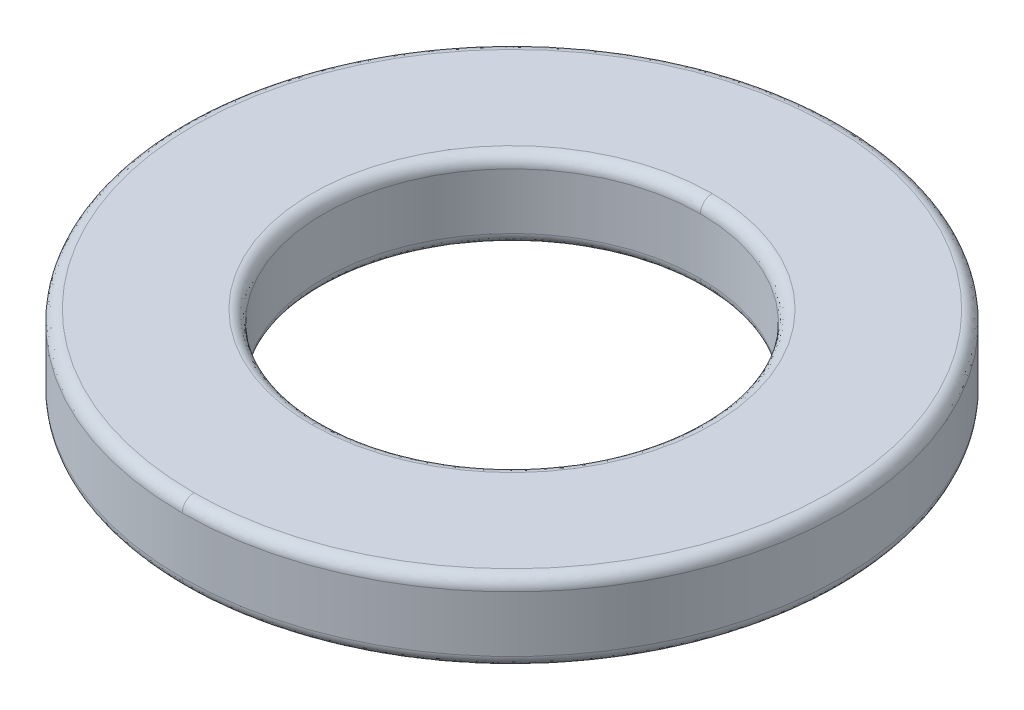
ISO-10303-21;
HEADER;
FILE_DESCRIPTION(('STEP AP214'),'2;1');
FILE_NAME('part.step','',(''),(''),'','','');
FILE_SCHEMA(('AUTOMOTIVE_DESIGN { 1 0 10303 214 1 1 1 1 }'));
ENDSEC;
DATA;
#1=APPLICATION_CONTEXT('core data for automotive mechanical design processes');
#2=APPLICATION_PROTOCOL_DEFINITION('international standard','automotive_design',2000,#1);
#3=PRODUCT_CONTEXT('',#1,'mechanical');
#4=PRODUCT('Part','Part','',(#3));
#5=PRODUCT_RELATED_PRODUCT_CATEGORY('part','',(#4));
#6=PRODUCT_DEFINITION_FORMATION('','',#4);
#7=PRODUCT_DEFINITION_CONTEXT('part definition',#1,'design');
#8=PRODUCT_DEFINITION('design','',#6,#7);
#9=PRODUCT_DEFINITION_SHAPE('','',#8);
#10=(LENGTH_UNIT() NAMED_UNIT(*) SI_UNIT(.MILLI.,.METRE.));
#11=(NAMED_UNIT(*) PLANE_ANGLE_UNIT() SI_UNIT($,.RADIAN.));
#12=(NAMED_UNIT(*) SI_UNIT($,.STERADIAN.) SOLID_ANGLE_UNIT());
#13=UNCERTAINTY_MEASURE_WITH_UNIT(LENGTH_MEASURE(1.E-05),#10,'distance_accuracy_value','');
#14=(GEOMETRIC_REPRESENTATION_CONTEXT(3) GLOBAL_UNCERTAINTY_ASSIGNED_CONTEXT((#13)) GLOBAL_UNIT_ASSIGNED_CONTEXT((#10,
#11,#12)) REPRESENTATION_CONTEXT('',''));
#15=CARTESIAN_POINT('',(0.,0.,0.));
#16=DIRECTION('',(0.,0.,1.));
#17=DIRECTION('',(1.,0.,0.));
#18=AXIS2_PLACEMENT_3D('',#15,#16,#17);
#19=CARTESIAN_POINT('',(0.,0.2793576836,-7.1107310668));
#20=CARTESIAN_POINT('',(-14.2214621082,0.2793576836,-7.1107310668));
#21=CARTESIAN_POINT('',(-14.2214621082,0.2793576836,7.1107310668));
#22=CARTESIAN_POINT('',(0.,0.2793576836,7.1107310668));
#23=CARTESIAN_POINT('',(0.,0.1066663348,-7.1280579816));
#24=CARTESIAN_POINT('',(-14.2561159632,0.1066663348,-7.1280579816));
#25=CARTESIAN_POINT('',(-14.2561159632,0.1066663348,7.1280579816));
#26=CARTESIAN_POINT('',(0.,0.1066663348,7.1280579816));
#27=CARTESIAN_POINT('',(0.,-0.0160579816,-7.0053336652));
#28=CARTESIAN_POINT('',(-14.010667305,-0.0160579816,-7.0053336652));
#29=CARTESIAN_POINT('',(-14.010667305,-0.0160579816,7.0053336652));
#30=CARTESIAN_POINT('',(0.,-0.0160579816,7.0053336652));
#31=CARTESIAN_POINT('',(0.,0.0012689332,-6.8326423164));
#32=CARTESIAN_POINT('',(-13.6652846328,0.0012689332,-6.8326423164));
#33=CARTESIAN_POINT('',(-13.6652846328,0.0012689332,6.8326423164));
#34=CARTESIAN_POINT('',(0.,0.0012689332,6.8326423164));
#35=(BOUNDED_SURFACE() B_SPLINE_SURFACE(3,3,((#19,#20,#21,#22),(#23,#24,#25,#26),(#27,#28,#29,
#30),(#31,#32,#33,#34)),.UNSPECIFIED.,.F.,.F.,.F.) B_SPLINE_SURFACE_WITH_KNOTS((4,4),(4,4),(0.,
1.),(0.,1.),.UNSPECIFIED.) GEOMETRIC_REPRESENTATION_ITEM() RATIONAL_B_SPLINE_SURFACE(((1.,
0.333333333333333,0.333333333333333,1.),(0.755320871117972,0.251773623705991,0.251773623705991,
0.755320871117972),(0.755320871117972,0.251773623705991,0.251773623705991,0.755320871117972),
(1.,0.333333333333333,0.333333333333333,1.))) REPRESENTATION_ITEM('') SURFACE());
#36=CARTESIAN_POINT('',(0.,0.2793576836,7.1107310668));
#37=CARTESIAN_POINT('',(0.,0.1066663348,7.1280579816));
#38=CARTESIAN_POINT('',(0.,-0.0160579816,7.0053336652));
#39=CARTESIAN_POINT('',(0.,0.0012689332,6.8326423164));
#40=(BOUNDED_CURVE() B_SPLINE_CURVE(3,(#36,#37,#38,#39),.UNSPECIFIED.,.F.,
.F.) B_SPLINE_CURVE_WITH_KNOTS((4,4),(0.,1.),
.UNSPECIFIED.) CURVE() GEOMETRIC_REPRESENTATION_ITEM() RATIONAL_B_SPLINE_CURVE((1.,
0.755320871117972,0.755320871117972,1.)) REPRESENTATION_ITEM(''));
#41=CARTESIAN_POINT('',(0.,-4.14162772376363E-09,6.85800000189381));
#42=VERTEX_POINT('',#41);
#43=CARTESIAN_POINT('',(0.,0.253999999380502,7.11200000172568));
#44=VERTEX_POINT('',#43);
#45=EDGE_CURVE('E91',#42,#44,#40,.F.);
#46=CARTESIAN_POINT('',(0.,0.2539999995174,0.));
#47=DIRECTION('',(0.,1.,0.));
#48=DIRECTION('',(0.,0.,1.));
#49=AXIS2_PLACEMENT_3D('',#46,#47,#48);
#50=CIRCLE('',#49,7.112);
#51=CARTESIAN_POINT('',(0.,0.253999999243604,-7.11200000172568));
#52=VERTEX_POINT('',#51);
#53=EDGE_CURVE('E87',#52,#44,#50,.T.);
#54=CARTESIAN_POINT('',(0.,0.2793576836,-7.1107310668));
#55=CARTESIAN_POINT('',(0.,0.1066663348,-7.1280579816));
#56=CARTESIAN_POINT('',(0.,-0.0160579816,-7.0053336652));
#57=CARTESIAN_POINT('',(0.,0.0012689332,-6.8326423164));
#58=(BOUNDED_CURVE() B_SPLINE_CURVE(3,(#54,#55,#56,#57),.UNSPECIFIED.,.F.,
.F.) B_SPLINE_CURVE_WITH_KNOTS((4,4),(0.,1.),
.UNSPECIFIED.) CURVE() GEOMETRIC_REPRESENTATION_ITEM() RATIONAL_B_SPLINE_CURVE((1.,
0.755320871117972,0.755320871117972,1.)) REPRESENTATION_ITEM(''));
#59=CARTESIAN_POINT('',(0.,-4.14162772377069E-09,-6.85800000189381));
#60=VERTEX_POINT('',#59);
#61=EDGE_CURVE('E80',#52,#60,#58,.T.);
#62=CARTESIAN_POINT('',(0.,-6.90271285358258E-09,-6.85800000570442));
#63=CARTESIAN_POINT('',(-13.7160000080677,-6.90271285608146E-09,-6.85800000570442));
#64=CARTESIAN_POINT('',(-13.7160000080677,-6.90271285608146E-09,6.85800000570442));
#65=CARTESIAN_POINT('',(0.,-6.90271285358258E-09,6.85800000570442));
#66=(BOUNDED_CURVE() B_SPLINE_CURVE(3,(#62,#63,#64,#65),.UNSPECIFIED.,.F.,
.F.) B_SPLINE_CURVE_WITH_KNOTS((4,4),(0.,1.),
.UNSPECIFIED.) CURVE() GEOMETRIC_REPRESENTATION_ITEM() RATIONAL_B_SPLINE_CURVE((0.956578300853963,
0.318859433617988,0.318859433617988,0.956578300853963)) REPRESENTATION_ITEM(''));
#67=EDGE_CURVE('E83',#60,#42,#66,.T.);
#68=ORIENTED_EDGE('',*,*,#45,.T.);
#69=ORIENTED_EDGE('',*,*,#53,.F.);
#70=ORIENTED_EDGE('',*,*,#61,.T.);
#71=ORIENTED_EDGE('',*,*,#67,.T.);
#72=EDGE_LOOP('',(#68,#69,#70,#71));
#73=FACE_BOUND('',#72,.T.);
#74=ADVANCED_FACE('F17',(#73),#35,.T.);
#75=CARTESIAN_POINT('',(0.,0.0012689332,-4.3433576836));
#76=CARTESIAN_POINT('',(-8.68671536720001,0.0012689332,-4.3433576836));
#77=CARTESIAN_POINT('',(-8.68671536720001,0.0012689332,4.3433576836));
#78=CARTESIAN_POINT('',(0.,0.0012689332,4.3433576836));
#79=CARTESIAN_POINT('',(0.,-0.0160579816,-4.1706663348));
#80=CARTESIAN_POINT('',(-8.341332695,-0.0160579816,-4.1706663348));
#81=CARTESIAN_POINT('',(-8.341332695,-0.0160579816,4.1706663348));
#82=CARTESIAN_POINT('',(0.,-0.0160579816,4.1706663348));
#83=CARTESIAN_POINT('',(0.,0.1066663348,-4.0479420184));
#84=CARTESIAN_POINT('',(-8.0958840368,0.1066663348,-4.0479420184));
#85=CARTESIAN_POINT('',(-8.0958840368,0.1066663348,4.0479420184));
#86=CARTESIAN_POINT('',(0.,0.1066663348,4.0479420184));
#87=CARTESIAN_POINT('',(0.,0.2793576836,-4.0652689332));
#88=CARTESIAN_POINT('',(-8.1305378918,0.2793576836,-4.0652689332));
#89=CARTESIAN_POINT('',(-8.1305378918,0.2793576836,4.0652689332));
#90=CARTESIAN_POINT('',(0.,0.2793576836,4.0652689332));
#91=(BOUNDED_SURFACE() B_SPLINE_SURFACE(3,3,((#75,#76,#77,#78),(#79,#80,#81,#82),(#83,#84,#85,
#86),(#87,#88,#89,#90)),.UNSPECIFIED.,.F.,.F.,.F.) B_SPLINE_SURFACE_WITH_KNOTS((4,4),(4,4),(0.,
1.),(0.,1.),.UNSPECIFIED.) GEOMETRIC_REPRESENTATION_ITEM() RATIONAL_B_SPLINE_SURFACE(((1.,
0.333333333333333,0.333333333333333,1.),(0.755320871117972,0.251773623705991,0.251773623705991,
0.755320871117972),(0.755320871117972,0.251773623705991,0.251773623705991,0.755320871117972),
(1.,0.333333333333333,0.333333333333333,1.))) REPRESENTATION_ITEM('') SURFACE());
#92=CARTESIAN_POINT('',(0.,0.0012689332,4.3433576836));
#93=CARTESIAN_POINT('',(0.,-0.0160579816,4.1706663348));
#94=CARTESIAN_POINT('',(0.,0.1066663348,4.0479420184));
#95=CARTESIAN_POINT('',(0.,0.2793576836,4.0652689332));
#96=(BOUNDED_CURVE() B_SPLINE_CURVE(3,(#92,#93,#94,#95),.UNSPECIFIED.,.F.,
.F.) B_SPLINE_CURVE_WITH_KNOTS((4,4),(0.,1.),
.UNSPECIFIED.) CURVE() GEOMETRIC_REPRESENTATION_ITEM() RATIONAL_B_SPLINE_CURVE((1.,
0.755320871117972,0.755320871117972,1.)) REPRESENTATION_ITEM(''));
#97=CARTESIAN_POINT('',(0.,-4.1416277238792E-09,4.31799999773962));
#98=VERTEX_POINT('',#97);
#99=CARTESIAN_POINT('',(0.,0.253999998422214,4.06399999827432));
#100=VERTEX_POINT('',#99);
#101=EDGE_CURVE('E99',#98,#100,#96,.T.);
#102=CARTESIAN_POINT('',(0.,-6.90271285362342E-09,4.31799999429559));
#103=CARTESIAN_POINT('',(-8.63599999193234,-6.90271285623411E-09,4.31799999429559));
#104=CARTESIAN_POINT('',(-8.63599999193234,-6.90271285623411E-09,-4.31799999429559));
#105=CARTESIAN_POINT('',(0.,-6.90271285362342E-09,-4.31799999429559));
#106=(BOUNDED_CURVE() B_SPLINE_CURVE(3,(#102,#103,#104,#105),.UNSPECIFIED.,.F.,
.F.) B_SPLINE_CURVE_WITH_KNOTS((4,4),(0.,1.),
.UNSPECIFIED.) CURVE() GEOMETRIC_REPRESENTATION_ITEM() RATIONAL_B_SPLINE_CURVE((0.956578300853963,
0.318859433617988,0.318859433617988,0.956578300853963)) REPRESENTATION_ITEM(''));
#107=CARTESIAN_POINT('',(0.,-4.14162772385223E-09,-4.31799999773962));
#108=VERTEX_POINT('',#107);
#109=EDGE_CURVE('E98',#98,#108,#106,.T.);
#110=CARTESIAN_POINT('',(0.,0.0012689332,-4.3433576836));
#111=CARTESIAN_POINT('',(0.,-0.0160579816,-4.1706663348));
#112=CARTESIAN_POINT('',(0.,0.1066663348,-4.0479420184));
#113=CARTESIAN_POINT('',(0.,0.2793576836,-4.0652689332));
#114=(BOUNDED_CURVE() B_SPLINE_CURVE(3,(#110,#111,#112,#113),.UNSPECIFIED.,.F.,
.F.) B_SPLINE_CURVE_WITH_KNOTS((4,4),(0.,1.),
.UNSPECIFIED.) CURVE() GEOMETRIC_REPRESENTATION_ITEM() RATIONAL_B_SPLINE_CURVE((1.,
0.755320871117972,0.755320871117972,1.)) REPRESENTATION_ITEM(''));
#115=CARTESIAN_POINT('',(0.,0.253999998422214,-4.06399999827432));
#116=VERTEX_POINT('',#115);
#117=EDGE_CURVE('E241',#116,#108,#114,.F.);
#118=CARTESIAN_POINT('',(0.,0.2539999995174,0.));
#119=DIRECTION('',(0.,1.,0.));
#120=DIRECTION('',(0.,0.,1.));
#121=AXIS2_PLACEMENT_3D('',#118,#119,#120);
#122=CIRCLE('',#121,4.064);
#123=EDGE_CURVE('E114',#116,#100,#122,.T.);
#124=ORIENTED_EDGE('',*,*,#101,.F.);
#125=ORIENTED_EDGE('',*,*,#109,.T.);
#126=ORIENTED_EDGE('',*,*,#117,.F.);
#127=ORIENTED_EDGE('',*,*,#123,.T.);
#128=EDGE_LOOP('',(#124,#125,#126,#127));
#129=FACE_BOUND('',#128,.T.);
#130=ADVANCED_FACE('F144',(#129),#91,.T.);
#131=CARTESIAN_POINT('',(0.,0.0012689332,4.3433576836));
#132=CARTESIAN_POINT('',(8.68671536720001,0.0012689332,4.3433576836));
#133=CARTESIAN_POINT('',(8.68671536720001,0.0012689332,-4.3433576836));
#134=CARTESIAN_POINT('',(0.,0.0012689332,-4.3433576836));
#135=CARTESIAN_POINT('',(0.,-0.0160579816,4.1706663348));
#136=CARTESIAN_POINT('',(8.341332695,-0.0160579816,4.1706663348));
#137=CARTESIAN_POINT('',(8.341332695,-0.0160579816,-4.1706663348));
#138=CARTESIAN_POINT('',(0.,-0.0160579816,-4.1706663348));
#139=CARTESIAN_POINT('',(0.,0.1066663348,4.0479420184));
#140=CARTESIAN_POINT('',(8.0958840368,0.1066663348,4.0479420184));
#141=CARTESIAN_POINT('',(8.0958840368,0.1066663348,-4.0479420184));
#142=CARTESIAN_POINT('',(0.,0.1066663348,-4.0479420184));
#143=CARTESIAN_POINT('',(0.,0.2793576836,4.0652689332));
#144=CARTESIAN_POINT('',(8.1305378918,0.2793576836,4.0652689332));
#145=CARTESIAN_POINT('',(8.1305378918,0.2793576836,-4.0652689332));
#146=CARTESIAN_POINT('',(0.,0.2793576836,-4.0652689332));
#147=(BOUNDED_SURFACE() B_SPLINE_SURFACE(3,3,((#131,#132,#133,#134),(#135,#136,#137,#138),(#139,
#140,#141,#142),(#143,#144,#145,#146)),.UNSPECIFIED.,.F.,.F.,
.F.) B_SPLINE_SURFACE_WITH_KNOTS((4,4),(4,4),(0.,1.),(0.,1.),
.UNSPECIFIED.) GEOMETRIC_REPRESENTATION_ITEM() RATIONAL_B_SPLINE_SURFACE(((1.,0.333333333333333,
0.333333333333333,1.),(0.755320871117972,0.251773623705991,0.251773623705991,0.755320871117972),
(0.755320871117972,0.251773623705991,0.251773623705991,0.755320871117972),(1.,0.333333333333333,
0.333333333333333,1.))) REPRESENTATION_ITEM('') SURFACE());
#148=CARTESIAN_POINT('',(0.,-6.90271285370474E-09,-4.31799999429559));
#149=CARTESIAN_POINT('',(8.63599999193234,-6.90271285622751E-09,-4.31799999429559));
#150=CARTESIAN_POINT('',(8.63599999193234,-6.90271285622751E-09,4.31799999429559));
#151=CARTESIAN_POINT('',(0.,-6.90271285370474E-09,4.31799999429559));
#152=(BOUNDED_CURVE() B_SPLINE_CURVE(3,(#148,#149,#150,#151),.UNSPECIFIED.,.F.,
.F.) B_SPLINE_CURVE_WITH_KNOTS((4,4),(0.,1.),
.UNSPECIFIED.) CURVE() GEOMETRIC_REPRESENTATION_ITEM() RATIONAL_B_SPLINE_CURVE((0.956578300853963,
0.318859433617987,0.318859433617987,0.956578300853963)) REPRESENTATION_ITEM(''));
#153=EDGE_CURVE('E224',#108,#98,#152,.T.);
#154=CARTESIAN_POINT('',(0.,0.2539999995174,0.));
#155=DIRECTION('',(0.,1.,0.));
#156=DIRECTION('',(0.,0.,1.));
#157=AXIS2_PLACEMENT_3D('',#154,#155,#156);
#158=CIRCLE('',#157,4.064);
#159=EDGE_CURVE('E105',#100,#116,#158,.T.);
#160=ORIENTED_EDGE('',*,*,#153,.T.);
#161=ORIENTED_EDGE('',*,*,#101,.T.);
#162=ORIENTED_EDGE('',*,*,#159,.T.);
#163=ORIENTED_EDGE('',*,*,#117,.T.);
#164=EDGE_LOOP('',(#160,#161,#162,#163));
#165=FACE_BOUND('',#164,.T.);
#166=ADVANCED_FACE('F133',(#165),#147,.T.);
#167=CARTESIAN_POINT('',(-6.940296,0.,-6.940296));
#168=DIRECTION('',(0.,1.,0.));
#169=DIRECTION('',(0.,0.,1.));
#170=AXIS2_PLACEMENT_3D('',#167,#168,#169);
#171=PLANE('',#170);
#172=ORIENTED_EDGE('',*,*,#109,.F.);
#173=ORIENTED_EDGE('',*,*,#153,.F.);
#174=EDGE_LOOP('',(#172,#173));
#175=FACE_BOUND('',#174,.T.);
#176=CARTESIAN_POINT('',(0.,-6.9027128536111E-09,6.85800000570442));
#177=CARTESIAN_POINT('',(13.7160000080677,-6.9027128560322E-09,6.85800000570442));
#178=CARTESIAN_POINT('',(13.7160000080677,-6.9027128560322E-09,-6.85800000570442));
#179=CARTESIAN_POINT('',(0.,-6.9027128536111E-09,-6.85800000570442));
#180=(BOUNDED_CURVE() B_SPLINE_CURVE(3,(#176,#177,#178,#179),.UNSPECIFIED.,.F.,
.F.) B_SPLINE_CURVE_WITH_KNOTS((4,4),(0.,1.),
.UNSPECIFIED.) CURVE() GEOMETRIC_REPRESENTATION_ITEM() RATIONAL_B_SPLINE_CURVE((0.956578300853963,
0.318859433617987,0.318859433617987,0.956578300853963)) REPRESENTATION_ITEM(''));
#181=EDGE_CURVE('E96',#42,#60,#180,.T.);
#182=ORIENTED_EDGE('',*,*,#181,.F.);
#183=ORIENTED_EDGE('',*,*,#67,.F.);
#184=EDGE_LOOP('',(#182,#183));
#185=FACE_BOUND('',#184,.T.);
#186=ADVANCED_FACE('F95',(#175,#185),#171,.F.);
#187=CARTESIAN_POINT('',(0.,1.58115,0.));
#188=DIRECTION('',(0.,-1.,0.));
#189=DIRECTION('',(0.,0.,-1.));
#190=AXIS2_PLACEMENT_3D('',#187,#188,#189);
#191=CYLINDRICAL_SURFACE('',#190,4.064);
#192=CARTESIAN_POINT('',(0.,1.46050000486334,0.));
#193=DIRECTION('',(0.,-1.,0.));
#194=DIRECTION('',(1.,0.,0.));
#195=AXIS2_PLACEMENT_3D('',#192,#193,#194);
#196=CIRCLE('',#195,4.06399999309729);
#197=CARTESIAN_POINT('',(0.,1.46050000486334,-4.06399999482297));
#198=VERTEX_POINT('',#197);
#199=CARTESIAN_POINT('',(0.,1.46050000376816,4.06399999482297));
#200=VERTEX_POINT('',#199);
#201=EDGE_CURVE('E267',#198,#200,#196,.T.);
#202=ORIENTED_EDGE('',*,*,#201,.F.);
#203=CARTESIAN_POINT('',(0.,1.46050000486334,0.));
#204=DIRECTION('',(0.,-1.,0.));
#205=DIRECTION('',(1.,0.,0.));
#206=AXIS2_PLACEMENT_3D('',#203,#204,#205);
#207=CIRCLE('',#206,4.06399999309729);
#208=EDGE_CURVE('E291',#200,#198,#207,.T.);
#209=ORIENTED_EDGE('',*,*,#208,.F.);
#210=EDGE_LOOP('',(#202,#209));
#211=FACE_BOUND('',#210,.T.);
#212=ORIENTED_EDGE('',*,*,#123,.F.);
#213=ORIENTED_EDGE('',*,*,#159,.F.);
#214=EDGE_LOOP('',(#212,#213));
#215=FACE_BOUND('',#214,.T.);
#216=ADVANCED_FACE('F128',(#211,#215),#191,.F.);
#217=CARTESIAN_POINT('',(0.,0.2793576836,7.1107310668));
#218=CARTESIAN_POINT('',(14.2214621082,0.2793576836,7.1107310668));
#219=CARTESIAN_POINT('',(14.2214621082,0.2793576836,-7.1107310668));
#220=CARTESIAN_POINT('',(0.,0.2793576836,-7.1107310668));
#221=CARTESIAN_POINT('',(0.,0.1066663348,7.1280579816));
#222=CARTESIAN_POINT('',(14.2561159632,0.1066663348,7.1280579816));
#223=CARTESIAN_POINT('',(14.2561159632,0.1066663348,-7.1280579816));
#224=CARTESIAN_POINT('',(0.,0.1066663348,-7.1280579816));
#225=CARTESIAN_POINT('',(0.,-0.0160579816,7.0053336652));
#226=CARTESIAN_POINT('',(14.010667305,-0.0160579816,7.0053336652));
#227=CARTESIAN_POINT('',(14.010667305,-0.0160579816,-7.0053336652));
#228=CARTESIAN_POINT('',(0.,-0.0160579816,-7.0053336652));
#229=CARTESIAN_POINT('',(0.,0.0012689332,6.8326423164));
#230=CARTESIAN_POINT('',(13.6652846328,0.0012689332,6.8326423164));
#231=CARTESIAN_POINT('',(13.6652846328,0.0012689332,-6.8326423164));
#232=CARTESIAN_POINT('',(0.,0.0012689332,-6.8326423164));
#233=(BOUNDED_SURFACE() B_SPLINE_SURFACE(3,3,((#217,#218,#219,#220),(#221,#222,#223,#224),(#225,
#226,#227,#228),(#229,#230,#231,#232)),.UNSPECIFIED.,.F.,.F.,
.F.) B_SPLINE_SURFACE_WITH_KNOTS((4,4),(4,4),(0.,1.),(0.,1.),
.UNSPECIFIED.) GEOMETRIC_REPRESENTATION_ITEM() RATIONAL_B_SPLINE_SURFACE(((1.,0.333333333333333,
0.333333333333333,1.),(0.755320871117972,0.251773623705991,0.251773623705991,0.755320871117972),
(0.755320871117972,0.251773623705991,0.251773623705991,0.755320871117972),(1.,0.333333333333333,
0.333333333333333,1.))) REPRESENTATION_ITEM('') SURFACE());
#234=CARTESIAN_POINT('',(0.,0.2539999995174,0.));
#235=DIRECTION('',(0.,1.,0.));
#236=DIRECTION('',(0.,0.,1.));
#237=AXIS2_PLACEMENT_3D('',#234,#235,#236);
#238=CIRCLE('',#237,7.112);
#239=EDGE_CURVE('E259',#44,#52,#238,.T.);
#240=ORIENTED_EDGE('',*,*,#239,.F.);
#241=ORIENTED_EDGE('',*,*,#45,.F.);
#242=ORIENTED_EDGE('',*,*,#181,.T.);
#243=ORIENTED_EDGE('',*,*,#61,.F.);
#244=EDGE_LOOP('',(#240,#241,#242,#243));
#245=FACE_BOUND('',#244,.T.);
#246=ADVANCED_FACE('F103',(#245),#233,.T.);
#247=CARTESIAN_POINT('',(0.,1.7132310668,-6.8326423164));
#248=CARTESIAN_POINT('',(-13.6652846328,1.7132310668,-6.8326423164));
#249=CARTESIAN_POINT('',(-13.6652846328,1.7132310668,6.8326423164));
#250=CARTESIAN_POINT('',(0.,1.7132310668,6.8326423164));
#251=CARTESIAN_POINT('',(0.,1.7305579816,-7.0053336652));
#252=CARTESIAN_POINT('',(-14.010667305,1.7305579816,-7.0053336652));
#253=CARTESIAN_POINT('',(-14.010667305,1.7305579816,7.0053336652));
#254=CARTESIAN_POINT('',(0.,1.7305579816,7.0053336652));
#255=CARTESIAN_POINT('',(0.,1.6078336652,-7.1280579816));
#256=CARTESIAN_POINT('',(-14.2561159632,1.6078336652,-7.1280579816));
#257=CARTESIAN_POINT('',(-14.2561159632,1.6078336652,7.1280579816));
#258=CARTESIAN_POINT('',(0.,1.6078336652,7.1280579816));
#259=CARTESIAN_POINT('',(0.,1.4351423164,-7.1107310668));
#260=CARTESIAN_POINT('',(-14.2214621082,1.4351423164,-7.1107310668));
#261=CARTESIAN_POINT('',(-14.2214621082,1.4351423164,7.1107310668));
#262=CARTESIAN_POINT('',(0.,1.4351423164,7.1107310668));
#263=(BOUNDED_SURFACE() B_SPLINE_SURFACE(3,3,((#247,#248,#249,#250),(#251,#252,#253,#254),(#255,
#256,#257,#258),(#259,#260,#261,#262)),.UNSPECIFIED.,.F.,.F.,
.F.) B_SPLINE_SURFACE_WITH_KNOTS((4,4),(4,4),(0.,1.),(0.,1.),
.UNSPECIFIED.) GEOMETRIC_REPRESENTATION_ITEM() RATIONAL_B_SPLINE_SURFACE(((1.,0.333333333333333,
0.333333333333333,1.),(0.755320871117972,0.251773623705991,0.251773623705991,0.755320871117972),
(0.755320871117972,0.251773623705991,0.251773623705991,0.755320871117972),(1.,0.333333333333333,
0.333333333333333,1.))) REPRESENTATION_ITEM('') SURFACE());
#264=CARTESIAN_POINT('',(0.,1.7132310668,6.8326423164));
#265=CARTESIAN_POINT('',(0.,1.7305579816,7.0053336652));
#266=CARTESIAN_POINT('',(0.,1.6078336652,7.1280579816));
#267=CARTESIAN_POINT('',(0.,1.4351423164,7.1107310668));
#268=(BOUNDED_CURVE() B_SPLINE_CURVE(3,(#264,#265,#266,#267),.UNSPECIFIED.,.F.,
.F.) B_SPLINE_CURVE_WITH_KNOTS((4,4),(0.,1.),
.UNSPECIFIED.) CURVE() GEOMETRIC_REPRESENTATION_ITEM() RATIONAL_B_SPLINE_CURVE((1.,
0.755320871117972,0.755320871117972,1.)) REPRESENTATION_ITEM(''));
#269=CARTESIAN_POINT('',(0.,1.46050000376816,7.11200000517703));
#270=VERTEX_POINT('',#269);
#271=CARTESIAN_POINT('',(0.,1.71450000414163,6.85800000189381));
#272=VERTEX_POINT('',#271);
#273=EDGE_CURVE('E37',#270,#272,#268,.F.);
#274=CARTESIAN_POINT('',(0.,1.71450000690271,6.85800000570442));
#275=CARTESIAN_POINT('',(-13.7160000080677,1.71450000690271,6.85800000570441));
#276=CARTESIAN_POINT('',(-13.7160000080677,1.71450000690271,-6.85800000570441));
#277=CARTESIAN_POINT('',(0.,1.71450000690271,-6.85800000570442));
#278=(BOUNDED_CURVE() B_SPLINE_CURVE(3,(#274,#275,#276,#277),.UNSPECIFIED.,.F.,
.F.) B_SPLINE_CURVE_WITH_KNOTS((4,4),(0.,1.),
.UNSPECIFIED.) CURVE() GEOMETRIC_REPRESENTATION_ITEM() RATIONAL_B_SPLINE_CURVE((0.956578300853964,
0.318859433617988,0.318859433617988,0.956578300853964)) REPRESENTATION_ITEM(''));
#279=CARTESIAN_POINT('',(0.,1.71450000414163,-6.85800000189381));
#280=VERTEX_POINT('',#279);
#281=EDGE_CURVE('E263',#280,#272,#278,.F.);
#282=CARTESIAN_POINT('',(0.,1.7132310668,-6.8326423164));
#283=CARTESIAN_POINT('',(0.,1.7305579816,-7.0053336652));
#284=CARTESIAN_POINT('',(0.,1.6078336652,-7.1280579816));
#285=CARTESIAN_POINT('',(0.,1.4351423164,-7.1107310668));
#286=(BOUNDED_CURVE() B_SPLINE_CURVE(3,(#282,#283,#284,#285),.UNSPECIFIED.,.F.,
.F.) B_SPLINE_CURVE_WITH_KNOTS((4,4),(0.,1.),
.UNSPECIFIED.) CURVE() GEOMETRIC_REPRESENTATION_ITEM() RATIONAL_B_SPLINE_CURVE((1.,
0.755320871117972,0.755320871117972,1.)) REPRESENTATION_ITEM(''));
#287=CARTESIAN_POINT('',(0.,1.46050000486334,-7.11200000517704));
#288=VERTEX_POINT('',#287);
#289=EDGE_CURVE('E104',#280,#288,#286,.T.);
#290=CARTESIAN_POINT('',(0.,1.46050000486334,0.));
#291=DIRECTION('',(0.,1.,0.));
#292=DIRECTION('',(-1.,0.,0.));
#293=AXIS2_PLACEMENT_3D('',#290,#291,#292);
#294=CIRCLE('',#293,7.11200000690271);
#295=EDGE_CURVE('E391',#288,#270,#294,.T.);
#296=ORIENTED_EDGE('',*,*,#273,.T.);
#297=ORIENTED_EDGE('',*,*,#281,.F.);
#298=ORIENTED_EDGE('',*,*,#289,.T.);
#299=ORIENTED_EDGE('',*,*,#295,.T.);
#300=EDGE_LOOP('',(#296,#297,#298,#299));
#301=FACE_BOUND('',#300,.T.);
#302=ADVANCED_FACE('F127',(#301),#263,.T.);
#303=CARTESIAN_POINT('',(0.,1.4351423164,-4.0652689332));
#304=CARTESIAN_POINT('',(-8.1305378918,1.4351423164,-4.0652689332));
#305=CARTESIAN_POINT('',(-8.1305378918,1.4351423164,4.0652689332));
#306=CARTESIAN_POINT('',(0.,1.4351423164,4.0652689332));
#307=CARTESIAN_POINT('',(0.,1.6078336652,-4.0479420184));
#308=CARTESIAN_POINT('',(-8.0958840368,1.6078336652,-4.0479420184));
#309=CARTESIAN_POINT('',(-8.0958840368,1.6078336652,4.0479420184));
#310=CARTESIAN_POINT('',(0.,1.6078336652,4.0479420184));
#311=CARTESIAN_POINT('',(0.,1.7305579816,-4.1706663348));
#312=CARTESIAN_POINT('',(-8.341332695,1.7305579816,-4.1706663348));
#313=CARTESIAN_POINT('',(-8.341332695,1.7305579816,4.1706663348));
#314=CARTESIAN_POINT('',(0.,1.7305579816,4.1706663348));
#315=CARTESIAN_POINT('',(0.,1.7132310668,-4.3433576836));
#316=CARTESIAN_POINT('',(-8.68671536720001,1.7132310668,-4.3433576836));
#317=CARTESIAN_POINT('',(-8.68671536720001,1.7132310668,4.3433576836));
#318=CARTESIAN_POINT('',(0.,1.7132310668,4.3433576836));
#319=(BOUNDED_SURFACE() B_SPLINE_SURFACE(3,3,((#303,#304,#305,#306),(#307,#308,#309,#310),(#311,
#312,#313,#314),(#315,#316,#317,#318)),.UNSPECIFIED.,.F.,.F.,
.F.) B_SPLINE_SURFACE_WITH_KNOTS((4,4),(4,4),(0.,1.),(0.,1.),
.UNSPECIFIED.) GEOMETRIC_REPRESENTATION_ITEM() RATIONAL_B_SPLINE_SURFACE(((1.,0.333333333333333,
0.333333333333333,1.),(0.755320871117972,0.251773623705991,0.251773623705991,0.755320871117972),
(0.755320871117972,0.251773623705991,0.251773623705991,0.755320871117972),(1.,0.333333333333333,
0.333333333333333,1.))) REPRESENTATION_ITEM('') SURFACE());
#320=CARTESIAN_POINT('',(0.,1.4351423164,4.0652689332));
#321=CARTESIAN_POINT('',(0.,1.6078336652,4.0479420184));
#322=CARTESIAN_POINT('',(0.,1.7305579816,4.1706663348));
#323=CARTESIAN_POINT('',(0.,1.7132310668,4.3433576836));
#324=(BOUNDED_CURVE() B_SPLINE_CURVE(3,(#320,#321,#322,#323),.UNSPECIFIED.,.F.,
.F.) B_SPLINE_CURVE_WITH_KNOTS((4,4),(0.,1.),
.UNSPECIFIED.) CURVE() GEOMETRIC_REPRESENTATION_ITEM() RATIONAL_B_SPLINE_CURVE((1.,
0.755320871117972,0.755320871117972,1.)) REPRESENTATION_ITEM(''));
#325=CARTESIAN_POINT('',(0.,1.71450000414163,4.31799999773962));
#326=VERTEX_POINT('',#325);
#327=EDGE_CURVE('E264',#200,#326,#324,.T.);
#328=CARTESIAN_POINT('',(0.,1.4351423164,-4.0652689332));
#329=CARTESIAN_POINT('',(0.,1.6078336652,-4.0479420184));
#330=CARTESIAN_POINT('',(0.,1.7305579816,-4.1706663348));
#331=CARTESIAN_POINT('',(0.,1.7132310668,-4.3433576836));
#332=(BOUNDED_CURVE() B_SPLINE_CURVE(3,(#328,#329,#330,#331),.UNSPECIFIED.,.F.,
.F.) B_SPLINE_CURVE_WITH_KNOTS((4,4),(0.,1.),
.UNSPECIFIED.) CURVE() GEOMETRIC_REPRESENTATION_ITEM() RATIONAL_B_SPLINE_CURVE((1.,
0.755320871117972,0.755320871117972,1.)) REPRESENTATION_ITEM(''));
#333=CARTESIAN_POINT('',(0.,1.71450000414163,-4.31799999773962));
#334=VERTEX_POINT('',#333);
#335=EDGE_CURVE('E274',#334,#198,#332,.F.);
#336=CARTESIAN_POINT('',(0.,1.71450000690271,-4.31799999429559));
#337=CARTESIAN_POINT('',(-8.63599999193234,1.71450000690271,-4.31799999429559));
#338=CARTESIAN_POINT('',(-8.63599999193234,1.71450000690271,4.31799999429559));
#339=CARTESIAN_POINT('',(0.,1.71450000690271,4.31799999429559));
#340=(BOUNDED_CURVE() B_SPLINE_CURVE(3,(#336,#337,#338,#339),.UNSPECIFIED.,.F.,
.F.) B_SPLINE_CURVE_WITH_KNOTS((4,4),(0.,1.),
.UNSPECIFIED.) CURVE() GEOMETRIC_REPRESENTATION_ITEM() RATIONAL_B_SPLINE_CURVE((0.956578300853962,
0.318859433617987,0.318859433617987,0.956578300853962)) REPRESENTATION_ITEM(''));
#341=EDGE_CURVE('E265',#326,#334,#340,.F.);
#342=ORIENTED_EDGE('',*,*,#327,.F.);
#343=ORIENTED_EDGE('',*,*,#208,.T.);
#344=ORIENTED_EDGE('',*,*,#335,.F.);
#345=ORIENTED_EDGE('',*,*,#341,.F.);
#346=EDGE_LOOP('',(#342,#343,#344,#345));
#347=FACE_BOUND('',#346,.T.);
#348=ADVANCED_FACE('F308',(#347),#319,.T.);
#349=CARTESIAN_POINT('',(0.,1.4351423164,4.0652689332));
#350=CARTESIAN_POINT('',(8.1305378918,1.4351423164,4.0652689332));
#351=CARTESIAN_POINT('',(8.1305378918,1.4351423164,-4.0652689332));
#352=CARTESIAN_POINT('',(0.,1.4351423164,-4.0652689332));
#353=CARTESIAN_POINT('',(0.,1.6078336652,4.0479420184));
#354=CARTESIAN_POINT('',(8.0958840368,1.6078336652,4.0479420184));
#355=CARTESIAN_POINT('',(8.0958840368,1.6078336652,-4.0479420184));
#356=CARTESIAN_POINT('',(0.,1.6078336652,-4.0479420184));
#357=CARTESIAN_POINT('',(0.,1.7305579816,4.1706663348));
#358=CARTESIAN_POINT('',(8.341332695,1.7305579816,4.1706663348));
#359=CARTESIAN_POINT('',(8.341332695,1.7305579816,-4.1706663348));
#360=CARTESIAN_POINT('',(0.,1.7305579816,-4.1706663348));
#361=CARTESIAN_POINT('',(0.,1.7132310668,4.3433576836));
#362=CARTESIAN_POINT('',(8.68671536720001,1.7132310668,4.3433576836));
#363=CARTESIAN_POINT('',(8.68671536720001,1.7132310668,-4.3433576836));
#364=CARTESIAN_POINT('',(0.,1.7132310668,-4.3433576836));
#365=(BOUNDED_SURFACE() B_SPLINE_SURFACE(3,3,((#349,#350,#351,#352),(#353,#354,#355,#356),(#357,
#358,#359,#360),(#361,#362,#363,#364)),.UNSPECIFIED.,.F.,.F.,
.F.) B_SPLINE_SURFACE_WITH_KNOTS((4,4),(4,4),(0.,1.),(0.,1.),
.UNSPECIFIED.) GEOMETRIC_REPRESENTATION_ITEM() RATIONAL_B_SPLINE_SURFACE(((1.,0.333333333333333,
0.333333333333333,1.),(0.755320871117972,0.251773623705991,0.251773623705991,0.755320871117972),
(0.755320871117972,0.251773623705991,0.251773623705991,0.755320871117972),(1.,0.333333333333333,
0.333333333333333,1.))) REPRESENTATION_ITEM('') SURFACE());
#366=CARTESIAN_POINT('',(0.,1.71450000690271,4.31799999429559));
#367=CARTESIAN_POINT('',(8.63599999193234,1.71450000690271,4.31799999429558));
#368=CARTESIAN_POINT('',(8.63599999193234,1.71450000690271,-4.31799999429558));
#369=CARTESIAN_POINT('',(0.,1.71450000690271,-4.31799999429559));
#370=(BOUNDED_CURVE() B_SPLINE_CURVE(3,(#366,#367,#368,#369),.UNSPECIFIED.,.F.,
.F.) B_SPLINE_CURVE_WITH_KNOTS((4,4),(0.,1.),
.UNSPECIFIED.) CURVE() GEOMETRIC_REPRESENTATION_ITEM() RATIONAL_B_SPLINE_CURVE((0.956578300853961,
0.318859433617987,0.318859433617987,0.956578300853961)) REPRESENTATION_ITEM(''));
#371=EDGE_CURVE('E355',#334,#326,#370,.F.);
#372=ORIENTED_EDGE('',*,*,#201,.T.);
#373=ORIENTED_EDGE('',*,*,#327,.T.);
#374=ORIENTED_EDGE('',*,*,#371,.F.);
#375=ORIENTED_EDGE('',*,*,#335,.T.);
#376=EDGE_LOOP('',(#372,#373,#374,#375));
#377=FACE_BOUND('',#376,.T.);
#378=ADVANCED_FACE('F318',(#377),#365,.T.);
#379=CARTESIAN_POINT('',(0.,1.58115,0.));
#380=DIRECTION('',(0.,-1.,0.));
#381=DIRECTION('',(0.,0.,-1.));
#382=AXIS2_PLACEMENT_3D('',#379,#380,#381);
#383=CYLINDRICAL_SURFACE('',#382,7.112);
#384=CARTESIAN_POINT('',(0.,1.46050000486334,0.));
#385=DIRECTION('',(0.,1.,0.));
#386=DIRECTION('',(-1.,0.,0.));
#387=AXIS2_PLACEMENT_3D('',#384,#385,#386);
#388=CIRCLE('',#387,7.11200000690271);
#389=EDGE_CURVE('E29',#270,#288,#388,.T.);
#390=ORIENTED_EDGE('',*,*,#389,.F.);
#391=ORIENTED_EDGE('',*,*,#295,.F.);
#392=EDGE_LOOP('',(#390,#391));
#393=FACE_BOUND('',#392,.T.);
#394=ORIENTED_EDGE('',*,*,#239,.T.);
#395=ORIENTED_EDGE('',*,*,#53,.T.);
#396=EDGE_LOOP('',(#394,#395));
#397=FACE_BOUND('',#396,.T.);
#398=ADVANCED_FACE('F329',(#393,#397),#383,.T.);
#399=CARTESIAN_POINT('',(-6.940296,1.7145,-6.940296));
#400=DIRECTION('',(0.,1.,0.));
#401=DIRECTION('',(0.,0.,1.));
#402=AXIS2_PLACEMENT_3D('',#399,#400,#401);
#403=PLANE('',#402);
#404=ORIENTED_EDGE('',*,*,#341,.T.);
#405=ORIENTED_EDGE('',*,*,#371,.T.);
#406=EDGE_LOOP('',(#404,#405));
#407=FACE_BOUND('',#406,.T.);
#408=CARTESIAN_POINT('',(0.,1.71450000690271,-6.85800000570441));
#409=CARTESIAN_POINT('',(13.7160000080677,1.71450000690271,-6.85800000570441));
#410=CARTESIAN_POINT('',(13.7160000080677,1.71450000690271,6.85800000570441));
#411=CARTESIAN_POINT('',(0.,1.71450000690271,6.85800000570441));
#412=(BOUNDED_CURVE() B_SPLINE_CURVE(3,(#408,#409,#410,#411),.UNSPECIFIED.,.F.,
.F.) B_SPLINE_CURVE_WITH_KNOTS((4,4),(0.,1.),
.UNSPECIFIED.) CURVE() GEOMETRIC_REPRESENTATION_ITEM() RATIONAL_B_SPLINE_CURVE((0.956578300853967,
0.318859433617989,0.318859433617989,0.956578300853967)) REPRESENTATION_ITEM(''));
#413=EDGE_CURVE('E11',#280,#272,#412,.T.);
#414=ORIENTED_EDGE('',*,*,#413,.F.);
#415=ORIENTED_EDGE('',*,*,#281,.T.);
#416=EDGE_LOOP('',(#414,#415));
#417=FACE_BOUND('',#416,.T.);
#418=ADVANCED_FACE('F19',(#407,#417),#403,.T.);
#419=CARTESIAN_POINT('',(0.,1.7132310668,6.8326423164));
#420=CARTESIAN_POINT('',(13.6652846328,1.7132310668,6.8326423164));
#421=CARTESIAN_POINT('',(13.6652846328,1.7132310668,-6.8326423164));
#422=CARTESIAN_POINT('',(0.,1.7132310668,-6.8326423164));
#423=CARTESIAN_POINT('',(0.,1.7305579816,7.0053336652));
#424=CARTESIAN_POINT('',(14.010667305,1.7305579816,7.0053336652));
#425=CARTESIAN_POINT('',(14.010667305,1.7305579816,-7.0053336652));
#426=CARTESIAN_POINT('',(0.,1.7305579816,-7.0053336652));
#427=CARTESIAN_POINT('',(0.,1.6078336652,7.1280579816));
#428=CARTESIAN_POINT('',(14.2561159632,1.6078336652,7.1280579816));
#429=CARTESIAN_POINT('',(14.2561159632,1.6078336652,-7.1280579816));
#430=CARTESIAN_POINT('',(0.,1.6078336652,-7.1280579816));
#431=CARTESIAN_POINT('',(0.,1.4351423164,7.1107310668));
#432=CARTESIAN_POINT('',(14.2214621082,1.4351423164,7.1107310668));
#433=CARTESIAN_POINT('',(14.2214621082,1.4351423164,-7.1107310668));
#434=CARTESIAN_POINT('',(0.,1.4351423164,-7.1107310668));
#435=(BOUNDED_SURFACE() B_SPLINE_SURFACE(3,3,((#419,#420,#421,#422),(#423,#424,#425,#426),(#427,
#428,#429,#430),(#431,#432,#433,#434)),.UNSPECIFIED.,.F.,.F.,
.F.) B_SPLINE_SURFACE_WITH_KNOTS((4,4),(4,4),(0.,1.),(0.,1.),
.UNSPECIFIED.) GEOMETRIC_REPRESENTATION_ITEM() RATIONAL_B_SPLINE_SURFACE(((1.,0.333333333333333,
0.333333333333333,1.),(0.755320871117972,0.251773623705991,0.251773623705991,0.755320871117972),
(0.755320871117972,0.251773623705991,0.251773623705991,0.755320871117972),(1.,0.333333333333333,
0.333333333333333,1.))) REPRESENTATION_ITEM('') SURFACE());
#436=ORIENTED_EDGE('',*,*,#413,.T.);
#437=ORIENTED_EDGE('',*,*,#273,.F.);
#438=ORIENTED_EDGE('',*,*,#389,.T.);
#439=ORIENTED_EDGE('',*,*,#289,.F.);
#440=EDGE_LOOP('',(#436,#437,#438,#439));
#441=FACE_BOUND('',#440,.T.);
#442=ADVANCED_FACE('F330',(#441),#435,.T.);
#443=CLOSED_SHELL('',(#74,#130,#166,#186,#216,#246,#302,#348,#378,#398,#418,#442));
#444=MANIFOLD_SOLID_BREP('B1',#443);
#445=ADVANCED_BREP_SHAPE_REPRESENTATION('',(#18,#444),#14);
#446=SHAPE_DEFINITION_REPRESENTATION(#9,#445);
ENDSEC;
END-ISO-10303-21;
